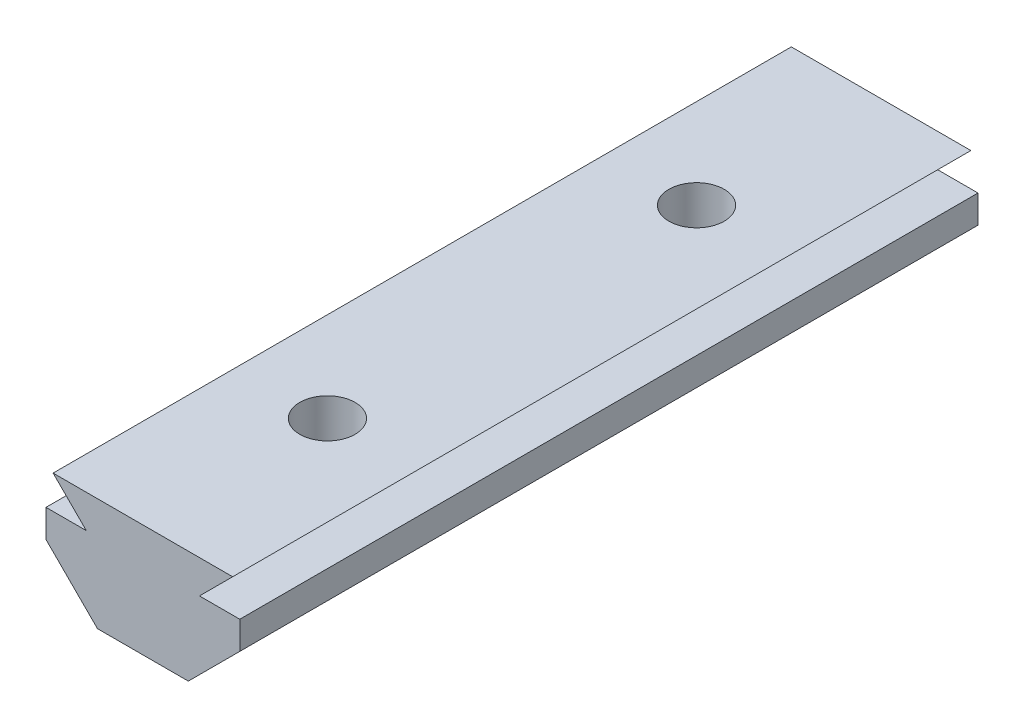
ISO-10303-21;
HEADER;
FILE_DESCRIPTION(('STEP AP214'),'2;1');
FILE_NAME('part.step','',(''),(''),'','','');
FILE_SCHEMA(('AUTOMOTIVE_DESIGN { 1 0 10303 214 1 1 1 1 }'));
ENDSEC;
DATA;
#1=APPLICATION_CONTEXT('core data for automotive mechanical design processes');
#2=APPLICATION_PROTOCOL_DEFINITION('international standard','automotive_design',2000,#1);
#3=PRODUCT_CONTEXT('',#1,'mechanical');
#4=PRODUCT('Part','Part','',(#3));
#5=PRODUCT_RELATED_PRODUCT_CATEGORY('part','',(#4));
#6=PRODUCT_DEFINITION_FORMATION('','',#4);
#7=PRODUCT_DEFINITION_CONTEXT('part definition',#1,'design');
#8=PRODUCT_DEFINITION('design','',#6,#7);
#9=PRODUCT_DEFINITION_SHAPE('','',#8);
#10=(LENGTH_UNIT() NAMED_UNIT(*) SI_UNIT(.MILLI.,.METRE.));
#11=(NAMED_UNIT(*) PLANE_ANGLE_UNIT() SI_UNIT($,.RADIAN.));
#12=(NAMED_UNIT(*) SI_UNIT($,.STERADIAN.) SOLID_ANGLE_UNIT());
#13=UNCERTAINTY_MEASURE_WITH_UNIT(LENGTH_MEASURE(1.E-05),#10,'distance_accuracy_value','');
#14=(GEOMETRIC_REPRESENTATION_CONTEXT(3) GLOBAL_UNCERTAINTY_ASSIGNED_CONTEXT((#13)) GLOBAL_UNIT_ASSIGNED_CONTEXT((#10,
#11,#12)) REPRESENTATION_CONTEXT('',''));
#15=CARTESIAN_POINT('',(0.,0.,0.));
#16=DIRECTION('',(0.,0.,1.));
#17=DIRECTION('',(1.,0.,0.));
#18=AXIS2_PLACEMENT_3D('',#15,#16,#17);
#19=CARTESIAN_POINT('',(-2.46065352773282,0.,40.));
#20=DIRECTION('',(0.,1.,0.));
#21=DIRECTION('',(-1.,0.,0.));
#22=AXIS2_PLACEMENT_3D('',#19,#20,#21);
#23=PLANE('',#22);
#24=DIRECTION('',(0.,0.,-1.));
#25=VECTOR('',#24,1.);
#26=CARTESIAN_POINT('',(2.46065352773283,0.,40.));
#27=LINE('',#26,#25);
#28=CARTESIAN_POINT('',(2.46065352773283,0.,8.66197692985686));
#29=VERTEX_POINT('',#28);
#30=CARTESIAN_POINT('',(2.46065352773283,0.,0.));
#31=VERTEX_POINT('',#30);
#32=EDGE_CURVE('E425',#29,#31,#27,.T.);
#33=ORIENTED_EDGE('',*,*,#32,.F.);
#34=DIRECTION('',(0.5,0.,0.866025403784439));
#35=VECTOR('',#34,1.);
#36=CARTESIAN_POINT('',(1.61658075373095,0.,7.2));
#37=LINE('',#36,#35);
#38=CARTESIAN_POINT('',(1.61658075373095,0.,7.2));
#39=VERTEX_POINT('',#38);
#40=EDGE_CURVE('E261',#39,#29,#37,.T.);
#41=ORIENTED_EDGE('',*,*,#40,.F.);
#42=DIRECTION('',(1.,0.,0.));
#43=VECTOR('',#42,1.);
#44=CARTESIAN_POINT('',(-1.61658075373095,0.,7.2));
#45=LINE('',#44,#43);
#46=CARTESIAN_POINT('',(-1.61658075373095,0.,7.2));
#47=VERTEX_POINT('',#46);
#48=EDGE_CURVE('E243',#47,#39,#45,.T.);
#49=ORIENTED_EDGE('',*,*,#48,.F.);
#50=DIRECTION('',(0.5,0.,-0.866025403784438));
#51=VECTOR('',#50,1.);
#52=CARTESIAN_POINT('',(-3.2331615074619,0.,10.));
#53=LINE('',#52,#51);
#54=CARTESIAN_POINT('',(-2.46065352773282,0.,8.66197692985685));
#55=VERTEX_POINT('',#54);
#56=EDGE_CURVE('E247',#55,#47,#53,.T.);
#57=ORIENTED_EDGE('',*,*,#56,.F.);
#58=DIRECTION('',(0.,0.,-1.));
#59=VECTOR('',#58,1.);
#60=CARTESIAN_POINT('',(-2.46065352773282,0.,40.));
#61=LINE('',#60,#59);
#62=CARTESIAN_POINT('',(-2.46065352773282,0.,0.));
#63=VERTEX_POINT('',#62);
#64=EDGE_CURVE('E461',#55,#63,#61,.T.);
#65=ORIENTED_EDGE('',*,*,#64,.T.);
#66=DIRECTION('',(1.,0.,0.));
#67=VECTOR('',#66,1.);
#68=CARTESIAN_POINT('',(-2.46065352773282,0.,0.));
#69=LINE('',#68,#67);
#70=EDGE_CURVE('E398',#63,#31,#69,.T.);
#71=ORIENTED_EDGE('',*,*,#70,.T.);
#72=EDGE_LOOP('',(#33,#41,#49,#57,#65,#71));
#73=FACE_BOUND('',#72,.T.);
#74=ADVANCED_FACE('F39',(#73),#23,.F.);
#75=CARTESIAN_POINT('',(-2.46065352773283,0.,28.6619769298569));
#76=VERTEX_POINT('',#75);
#77=CARTESIAN_POINT('',(-2.46065352773282,0.,11.3380230701432));
#78=VERTEX_POINT('',#77);
#79=EDGE_CURVE('E468',#76,#78,#61,.T.);
#80=ORIENTED_EDGE('',*,*,#79,.T.);
#81=DIRECTION('',(-0.5,0.,-0.866025403784439));
#82=VECTOR('',#81,1.);
#83=CARTESIAN_POINT('',(-1.61658075373095,0.,12.8));
#84=LINE('',#83,#82);
#85=CARTESIAN_POINT('',(-1.61658075373095,0.,12.8));
#86=VERTEX_POINT('',#85);
#87=EDGE_CURVE('E272',#86,#78,#84,.T.);
#88=ORIENTED_EDGE('',*,*,#87,.F.);
#89=DIRECTION('',(-1.,0.,0.));
#90=VECTOR('',#89,1.);
#91=CARTESIAN_POINT('',(1.61658075373095,0.,12.8));
#92=LINE('',#91,#90);
#93=CARTESIAN_POINT('',(1.61658075373095,0.,12.8));
#94=VERTEX_POINT('',#93);
#95=EDGE_CURVE('E268',#94,#86,#92,.T.);
#96=ORIENTED_EDGE('',*,*,#95,.F.);
#97=DIRECTION('',(-0.5,0.,0.866025403784439));
#98=VECTOR('',#97,1.);
#99=CARTESIAN_POINT('',(3.2331615074619,0.,10.));
#100=LINE('',#99,#98);
#101=CARTESIAN_POINT('',(2.46065352773283,0.,11.3380230701432));
#102=VERTEX_POINT('',#101);
#103=EDGE_CURVE('E264',#102,#94,#100,.T.);
#104=ORIENTED_EDGE('',*,*,#103,.F.);
#105=CARTESIAN_POINT('',(2.46065352773282,0.,28.6619769298568));
#106=VERTEX_POINT('',#105);
#107=EDGE_CURVE('E462',#106,#102,#27,.T.);
#108=ORIENTED_EDGE('',*,*,#107,.F.);
#109=DIRECTION('',(0.499999999999999,0.,0.866025403784439));
#110=VECTOR('',#109,1.);
#111=CARTESIAN_POINT('',(1.61658075373095,0.,27.2));
#112=LINE('',#111,#110);
#113=CARTESIAN_POINT('',(1.61658075373095,0.,27.2));
#114=VERTEX_POINT('',#113);
#115=EDGE_CURVE('E320',#114,#106,#112,.T.);
#116=ORIENTED_EDGE('',*,*,#115,.F.);
#117=DIRECTION('',(1.,0.,0.));
#118=VECTOR('',#117,1.);
#119=CARTESIAN_POINT('',(-1.61658075373094,0.,27.2));
#120=LINE('',#119,#118);
#121=CARTESIAN_POINT('',(-1.61658075373094,0.,27.2));
#122=VERTEX_POINT('',#121);
#123=EDGE_CURVE('E299',#122,#114,#120,.T.);
#124=ORIENTED_EDGE('',*,*,#123,.F.);
#125=DIRECTION('',(0.5,0.,-0.866025403784439));
#126=VECTOR('',#125,1.);
#127=CARTESIAN_POINT('',(-3.2331615074619,0.,30.));
#128=LINE('',#127,#126);
#129=EDGE_CURVE('E333',#76,#122,#128,.T.);
#130=ORIENTED_EDGE('',*,*,#129,.F.);
#131=EDGE_LOOP('',(#80,#88,#96,#104,#108,#116,#124,#130));
#132=FACE_BOUND('',#131,.T.);
#133=ADVANCED_FACE('F505',(#132),#23,.F.);
#134=CARTESIAN_POINT('',(0.,0.,10.));
#135=DIRECTION('',(0.,1.,0.));
#136=DIRECTION('',(-1.,0.,0.));
#137=AXIS2_PLACEMENT_3D('',#134,#135,#136);
#138=CYLINDRICAL_SURFACE('',#137,1.5);
#139=CARTESIAN_POINT('',(0.,6.1,10.));
#140=DIRECTION('',(0.,1.,0.));
#141=DIRECTION('',(-1.,0.,0.));
#142=AXIS2_PLACEMENT_3D('',#139,#140,#141);
#143=CIRCLE('',#142,1.5);
#144=CARTESIAN_POINT('',(-1.5,6.1,10.));
#145=VERTEX_POINT('',#144);
#146=EDGE_CURVE('E384',#145,#145,#143,.T.);
#147=ORIENTED_EDGE('',*,*,#146,.T.);
#148=EDGE_LOOP('',(#147));
#149=FACE_BOUND('',#148,.T.);
#150=CARTESIAN_POINT('',(0.,3.,10.));
#151=DIRECTION('',(0.,-1.,0.));
#152=DIRECTION('',(1.,0.,0.));
#153=AXIS2_PLACEMENT_3D('',#150,#151,#152);
#154=CIRCLE('',#153,1.5);
#155=CARTESIAN_POINT('',(1.5,3.,10.));
#156=VERTEX_POINT('',#155);
#157=EDGE_CURVE('E43',#156,#156,#154,.F.);
#158=ORIENTED_EDGE('',*,*,#157,.F.);
#159=EDGE_LOOP('',(#158));
#160=FACE_BOUND('',#159,.T.);
#161=ADVANCED_FACE('F502',(#149,#160),#138,.F.);
#162=CARTESIAN_POINT('',(0.,0.,30.));
#163=DIRECTION('',(0.,1.,0.));
#164=DIRECTION('',(-1.,0.,0.));
#165=AXIS2_PLACEMENT_3D('',#162,#163,#164);
#166=CYLINDRICAL_SURFACE('',#165,1.5);
#167=CARTESIAN_POINT('',(0.,6.1,30.));
#168=DIRECTION('',(0.,1.,0.));
#169=DIRECTION('',(-1.,0.,0.));
#170=AXIS2_PLACEMENT_3D('',#167,#168,#169);
#171=CIRCLE('',#170,1.5);
#172=CARTESIAN_POINT('',(-1.5,6.1,30.));
#173=VERTEX_POINT('',#172);
#174=EDGE_CURVE('E385',#173,#173,#171,.T.);
#175=ORIENTED_EDGE('',*,*,#174,.T.);
#176=EDGE_LOOP('',(#175));
#177=FACE_BOUND('',#176,.T.);
#178=CARTESIAN_POINT('',(0.,3.,30.));
#179=DIRECTION('',(0.,-1.,0.));
#180=DIRECTION('',(1.,0.,0.));
#181=AXIS2_PLACEMENT_3D('',#178,#179,#180);
#182=CIRCLE('',#181,1.5);
#183=CARTESIAN_POINT('',(1.5,3.,30.));
#184=VERTEX_POINT('',#183);
#185=EDGE_CURVE('E280',#184,#184,#182,.F.);
#186=ORIENTED_EDGE('',*,*,#185,.F.);
#187=EDGE_LOOP('',(#186));
#188=FACE_BOUND('',#187,.T.);
#189=ADVANCED_FACE('F504',(#177,#188),#166,.F.);
#190=CARTESIAN_POINT('',(2.46065352773283,0.,40.));
#191=DIRECTION('',(-0.707106781186543,0.707106781186552,0.));
#192=DIRECTION('',(-0.707106781186552,-0.707106781186543,0.));
#193=AXIS2_PLACEMENT_3D('',#190,#191,#192);
#194=PLANE('',#193);
#195=DIRECTION('',(0.447213595499959,0.447213595499954,-0.774596669241485));
#196=VECTOR('',#195,1.);
#197=CARTESIAN_POINT('',(-7.46814652984304,-9.92880005757574,28.5352092280573));
#198=LINE('',#197,#196);
#199=CARTESIAN_POINT('',(3.2331615074619,0.772507979729072,10.));
#200=VERTEX_POINT('',#199);
#201=EDGE_CURVE('E57',#102,#200,#198,.T.);
#202=ORIENTED_EDGE('',*,*,#201,.T.);
#203=DIRECTION('',(-0.447213595499959,-0.447213595499953,-0.774596669241486));
#204=VECTOR('',#203,1.);
#205=CARTESIAN_POINT('',(13.3164631609836,10.8558096332506,27.4647907719429));
#206=LINE('',#205,#204);
#207=EDGE_CURVE('E223',#200,#29,#206,.T.);
#208=ORIENTED_EDGE('',*,*,#207,.T.);
#209=ORIENTED_EDGE('',*,*,#32,.T.);
#210=DIRECTION('',(0.707106781186552,0.707106781186543,0.));
#211=VECTOR('',#210,1.);
#212=CARTESIAN_POINT('',(2.46065352773283,0.,0.));
#213=LINE('',#212,#211);
#214=CARTESIAN_POINT('',(5.25,2.78934647226715,0.));
#215=VERTEX_POINT('',#214);
#216=EDGE_CURVE('E389',#31,#215,#213,.T.);
#217=ORIENTED_EDGE('',*,*,#216,.T.);
#218=DIRECTION('',(0.,0.,-1.));
#219=VECTOR('',#218,1.);
#220=CARTESIAN_POINT('',(5.25,2.78934647226715,40.));
#221=LINE('',#220,#219);
#222=CARTESIAN_POINT('',(5.25,2.78934647226715,40.));
#223=VERTEX_POINT('',#222);
#224=EDGE_CURVE('E11',#223,#215,#221,.T.);
#225=ORIENTED_EDGE('',*,*,#224,.F.);
#226=DIRECTION('',(0.707106781186552,0.707106781186543,0.));
#227=VECTOR('',#226,1.);
#228=CARTESIAN_POINT('',(2.46065352773283,0.,40.));
#229=LINE('',#228,#227);
#230=CARTESIAN_POINT('',(2.46065352773283,0.,40.));
#231=VERTEX_POINT('',#230);
#232=EDGE_CURVE('E393',#231,#223,#229,.T.);
#233=ORIENTED_EDGE('',*,*,#232,.F.);
#234=CARTESIAN_POINT('',(2.46065352773282,0.,31.3380230701432));
#235=VERTEX_POINT('',#234);
#236=EDGE_CURVE('E457',#231,#235,#27,.T.);
#237=ORIENTED_EDGE('',*,*,#236,.T.);
#238=DIRECTION('',(0.447213595499959,0.447213595499954,-0.774596669241485));
#239=VECTOR('',#238,1.);
#240=CARTESIAN_POINT('',(-0.539943299567495,-3.00059682730028,36.5352092280573));
#241=LINE('',#240,#239);
#242=CARTESIAN_POINT('',(3.23316150746191,0.772507979729079,30.));
#243=VERTEX_POINT('',#242);
#244=EDGE_CURVE('E65',#235,#243,#241,.T.);
#245=ORIENTED_EDGE('',*,*,#244,.T.);
#246=DIRECTION('',(-0.447213595499959,-0.447213595499953,-0.774596669241486));
#247=VECTOR('',#246,1.);
#248=CARTESIAN_POINT('',(6.38825993070805,3.92760640297518,35.4647907719428));
#249=LINE('',#248,#247);
#250=EDGE_CURVE('E368',#243,#106,#249,.T.);
#251=ORIENTED_EDGE('',*,*,#250,.T.);
#252=ORIENTED_EDGE('',*,*,#107,.T.);
#253=EDGE_LOOP('',(#202,#208,#209,#217,#225,#233,#237,#245,#251,#252));
#254=FACE_BOUND('',#253,.T.);
#255=ADVANCED_FACE('F41',(#254),#194,.F.);
#256=CARTESIAN_POINT('',(5.25,2.78934647226715,40.));
#257=DIRECTION('',(-1.,0.,0.));
#258=DIRECTION('',(0.,0.,1.));
#259=AXIS2_PLACEMENT_3D('',#256,#257,#258);
#260=PLANE('',#259);
#261=DIRECTION('',(0.,1.,0.));
#262=VECTOR('',#261,1.);
#263=CARTESIAN_POINT('',(5.25,2.78934647226715,0.));
#264=LINE('',#263,#262);
#265=CARTESIAN_POINT('',(5.25,4.3,0.));
#266=VERTEX_POINT('',#265);
#267=EDGE_CURVE('E429',#215,#266,#264,.T.);
#268=ORIENTED_EDGE('',*,*,#267,.T.);
#269=DIRECTION('',(0.,0.,-1.));
#270=VECTOR('',#269,1.);
#271=CARTESIAN_POINT('',(5.25,4.3,40.));
#272=LINE('',#271,#270);
#273=CARTESIAN_POINT('',(5.25,4.3,40.));
#274=VERTEX_POINT('',#273);
#275=EDGE_CURVE('E49',#274,#266,#272,.T.);
#276=ORIENTED_EDGE('',*,*,#275,.F.);
#277=DIRECTION('',(0.,1.,0.));
#278=VECTOR('',#277,1.);
#279=CARTESIAN_POINT('',(5.25,2.78934647226715,40.));
#280=LINE('',#279,#278);
#281=EDGE_CURVE('E397',#223,#274,#280,.T.);
#282=ORIENTED_EDGE('',*,*,#281,.F.);
#283=ORIENTED_EDGE('',*,*,#224,.T.);
#284=EDGE_LOOP('',(#268,#276,#282,#283));
#285=FACE_BOUND('',#284,.T.);
#286=ADVANCED_FACE('F682',(#285),#260,.F.);
#287=CARTESIAN_POINT('',(5.25,4.3,40.));
#288=DIRECTION('',(0.,-1.,0.));
#289=DIRECTION('',(0.,0.,-1.));
#290=AXIS2_PLACEMENT_3D('',#287,#288,#289);
#291=PLANE('',#290);
#292=DIRECTION('',(-1.,0.,0.));
#293=VECTOR('',#292,1.);
#294=CARTESIAN_POINT('',(5.25,4.3,0.));
#295=LINE('',#294,#293);
#296=CARTESIAN_POINT('',(3.065,4.3,0.));
#297=VERTEX_POINT('',#296);
#298=EDGE_CURVE('E432',#266,#297,#295,.T.);
#299=ORIENTED_EDGE('',*,*,#298,.T.);
#300=DIRECTION('',(0.,0.,-1.));
#301=VECTOR('',#300,1.);
#302=CARTESIAN_POINT('',(3.065,4.3,40.));
#303=LINE('',#302,#301);
#304=CARTESIAN_POINT('',(3.065,4.3,40.));
#305=VERTEX_POINT('',#304);
#306=EDGE_CURVE('E488',#305,#297,#303,.T.);
#307=ORIENTED_EDGE('',*,*,#306,.F.);
#308=DIRECTION('',(-1.,0.,0.));
#309=VECTOR('',#308,1.);
#310=CARTESIAN_POINT('',(5.25,4.3,40.));
#311=LINE('',#310,#309);
#312=EDGE_CURVE('E401',#274,#305,#311,.T.);
#313=ORIENTED_EDGE('',*,*,#312,.F.);
#314=ORIENTED_EDGE('',*,*,#275,.T.);
#315=EDGE_LOOP('',(#299,#307,#313,#314));
#316=FACE_BOUND('',#315,.T.);
#317=ADVANCED_FACE('F672',(#316),#291,.F.);
#318=CARTESIAN_POINT('',(3.065,4.3,40.));
#319=DIRECTION('',(-0.707106781186545,0.70710678118655,0.));
#320=DIRECTION('',(-0.70710678118655,-0.707106781186545,0.));
#321=AXIS2_PLACEMENT_3D('',#318,#319,#320);
#322=PLANE('',#321);
#323=DIRECTION('',(0.70710678118655,0.707106781186545,0.));
#324=VECTOR('',#323,1.);
#325=CARTESIAN_POINT('',(3.065,4.3,0.));
#326=LINE('',#325,#324);
#327=CARTESIAN_POINT('',(4.86500000000002,6.1,0.));
#328=VERTEX_POINT('',#327);
#329=EDGE_CURVE('E435',#297,#328,#326,.T.);
#330=ORIENTED_EDGE('',*,*,#329,.T.);
#331=DIRECTION('',(0.,0.,-1.));
#332=VECTOR('',#331,1.);
#333=CARTESIAN_POINT('',(4.86500000000002,6.1,40.));
#334=LINE('',#333,#332);
#335=CARTESIAN_POINT('',(4.86500000000002,6.1,40.));
#336=VERTEX_POINT('',#335);
#337=EDGE_CURVE('E484',#336,#328,#334,.T.);
#338=ORIENTED_EDGE('',*,*,#337,.F.);
#339=DIRECTION('',(0.70710678118655,0.707106781186545,0.));
#340=VECTOR('',#339,1.);
#341=CARTESIAN_POINT('',(3.065,4.3,40.));
#342=LINE('',#341,#340);
#343=EDGE_CURVE('E404',#305,#336,#342,.T.);
#344=ORIENTED_EDGE('',*,*,#343,.F.);
#345=ORIENTED_EDGE('',*,*,#306,.T.);
#346=EDGE_LOOP('',(#330,#338,#344,#345));
#347=FACE_BOUND('',#346,.T.);
#348=ADVANCED_FACE('F667',(#347),#322,.F.);
#349=CARTESIAN_POINT('',(4.86500000000002,6.1,40.));
#350=DIRECTION('',(0.,-1.,0.));
#351=DIRECTION('',(1.,0.,0.));
#352=AXIS2_PLACEMENT_3D('',#349,#350,#351);
#353=PLANE('',#352);
#354=ORIENTED_EDGE('',*,*,#174,.F.);
#355=EDGE_LOOP('',(#354));
#356=FACE_BOUND('',#355,.T.);
#357=ORIENTED_EDGE('',*,*,#146,.F.);
#358=EDGE_LOOP('',(#357));
#359=FACE_BOUND('',#358,.T.);
#360=DIRECTION('',(-1.,0.,0.));
#361=VECTOR('',#360,1.);
#362=CARTESIAN_POINT('',(4.86500000000002,6.1,0.));
#363=LINE('',#362,#361);
#364=CARTESIAN_POINT('',(-4.86500000000002,6.1,0.));
#365=VERTEX_POINT('',#364);
#366=EDGE_CURVE('E438',#328,#365,#363,.T.);
#367=ORIENTED_EDGE('',*,*,#366,.T.);
#368=DIRECTION('',(0.,0.,-1.));
#369=VECTOR('',#368,1.);
#370=CARTESIAN_POINT('',(-4.86500000000002,6.1,40.));
#371=LINE('',#370,#369);
#372=CARTESIAN_POINT('',(-4.86500000000002,6.1,40.));
#373=VERTEX_POINT('',#372);
#374=EDGE_CURVE('E480',#373,#365,#371,.T.);
#375=ORIENTED_EDGE('',*,*,#374,.F.);
#376=DIRECTION('',(-1.,0.,0.));
#377=VECTOR('',#376,1.);
#378=CARTESIAN_POINT('',(4.86500000000002,6.1,40.));
#379=LINE('',#378,#377);
#380=EDGE_CURVE('E407',#336,#373,#379,.T.);
#381=ORIENTED_EDGE('',*,*,#380,.F.);
#382=ORIENTED_EDGE('',*,*,#337,.T.);
#383=EDGE_LOOP('',(#367,#375,#381,#382));
#384=FACE_BOUND('',#383,.T.);
#385=ADVANCED_FACE('F659',(#356,#359,#384),#353,.F.);
#386=CARTESIAN_POINT('',(-3.065,4.3,40.));
#387=DIRECTION('',(0.707106781186544,0.707106781186551,0.));
#388=DIRECTION('',(-0.707106781186551,0.707106781186544,0.));
#389=AXIS2_PLACEMENT_3D('',#386,#387,#388);
#390=PLANE('',#389);
#391=DIRECTION('',(0.707106781186551,-0.707106781186544,0.));
#392=VECTOR('',#391,1.);
#393=CARTESIAN_POINT('',(-3.065,4.3,0.));
#394=LINE('',#393,#392);
#395=CARTESIAN_POINT('',(-3.065,4.3,0.));
#396=VERTEX_POINT('',#395);
#397=EDGE_CURVE('E441',#365,#396,#394,.T.);
#398=ORIENTED_EDGE('',*,*,#397,.T.);
#399=DIRECTION('',(0.,0.,-1.));
#400=VECTOR('',#399,1.);
#401=CARTESIAN_POINT('',(-3.065,4.3,40.));
#402=LINE('',#401,#400);
#403=CARTESIAN_POINT('',(-3.065,4.3,40.));
#404=VERTEX_POINT('',#403);
#405=EDGE_CURVE('E476',#404,#396,#402,.T.);
#406=ORIENTED_EDGE('',*,*,#405,.F.);
#407=DIRECTION('',(0.707106781186551,-0.707106781186544,0.));
#408=VECTOR('',#407,1.);
#409=CARTESIAN_POINT('',(-3.065,4.3,40.));
#410=LINE('',#409,#408);
#411=EDGE_CURVE('E410',#373,#404,#410,.T.);
#412=ORIENTED_EDGE('',*,*,#411,.F.);
#413=ORIENTED_EDGE('',*,*,#374,.T.);
#414=EDGE_LOOP('',(#398,#406,#412,#413));
#415=FACE_BOUND('',#414,.T.);
#416=ADVANCED_FACE('F649',(#415),#390,.F.);
#417=CARTESIAN_POINT('',(-5.25,4.3,40.));
#418=DIRECTION('',(0.,-1.,0.));
#419=DIRECTION('',(1.,0.,0.));
#420=AXIS2_PLACEMENT_3D('',#417,#418,#419);
#421=PLANE('',#420);
#422=DIRECTION('',(-1.,0.,0.));
#423=VECTOR('',#422,1.);
#424=CARTESIAN_POINT('',(-5.25,4.3,0.));
#425=LINE('',#424,#423);
#426=CARTESIAN_POINT('',(-5.25,4.3,0.));
#427=VERTEX_POINT('',#426);
#428=EDGE_CURVE('E444',#396,#427,#425,.T.);
#429=ORIENTED_EDGE('',*,*,#428,.T.);
#430=DIRECTION('',(0.,0.,-1.));
#431=VECTOR('',#430,1.);
#432=CARTESIAN_POINT('',(-5.25,4.3,40.));
#433=LINE('',#432,#431);
#434=CARTESIAN_POINT('',(-5.25,4.3,40.));
#435=VERTEX_POINT('',#434);
#436=EDGE_CURVE('E472',#435,#427,#433,.T.);
#437=ORIENTED_EDGE('',*,*,#436,.F.);
#438=DIRECTION('',(-1.,0.,0.));
#439=VECTOR('',#438,1.);
#440=CARTESIAN_POINT('',(-5.25,4.3,40.));
#441=LINE('',#440,#439);
#442=EDGE_CURVE('E413',#404,#435,#441,.T.);
#443=ORIENTED_EDGE('',*,*,#442,.F.);
#444=ORIENTED_EDGE('',*,*,#405,.T.);
#445=EDGE_LOOP('',(#429,#437,#443,#444));
#446=FACE_BOUND('',#445,.T.);
#447=ADVANCED_FACE('F639',(#446),#421,.F.);
#448=CARTESIAN_POINT('',(-5.25,2.78934647226715,40.));
#449=DIRECTION('',(1.,0.,0.));
#450=DIRECTION('',(0.,1.,0.));
#451=AXIS2_PLACEMENT_3D('',#448,#449,#450);
#452=PLANE('',#451);
#453=DIRECTION('',(0.,-1.,0.));
#454=VECTOR('',#453,1.);
#455=CARTESIAN_POINT('',(-5.25,2.78934647226715,0.));
#456=LINE('',#455,#454);
#457=CARTESIAN_POINT('',(-5.25,2.78934647226715,0.));
#458=VERTEX_POINT('',#457);
#459=EDGE_CURVE('E447',#427,#458,#456,.T.);
#460=ORIENTED_EDGE('',*,*,#459,.T.);
#461=DIRECTION('',(0.,0.,-1.));
#462=VECTOR('',#461,1.);
#463=CARTESIAN_POINT('',(-5.25,2.78934647226715,40.));
#464=LINE('',#463,#462);
#465=CARTESIAN_POINT('',(-5.25,2.78934647226715,40.));
#466=VERTEX_POINT('',#465);
#467=EDGE_CURVE('E467',#466,#458,#464,.T.);
#468=ORIENTED_EDGE('',*,*,#467,.F.);
#469=DIRECTION('',(0.,-1.,0.));
#470=VECTOR('',#469,1.);
#471=CARTESIAN_POINT('',(-5.25,2.78934647226715,40.));
#472=LINE('',#471,#470);
#473=EDGE_CURVE('E416',#435,#466,#472,.T.);
#474=ORIENTED_EDGE('',*,*,#473,.F.);
#475=ORIENTED_EDGE('',*,*,#436,.T.);
#476=EDGE_LOOP('',(#460,#468,#474,#475));
#477=FACE_BOUND('',#476,.T.);
#478=ADVANCED_FACE('F535',(#477),#452,.F.);
#479=CARTESIAN_POINT('',(-2.46065352773282,0.,40.));
#480=DIRECTION('',(0.707106781186543,0.707106781186552,0.));
#481=DIRECTION('',(-0.707106781186552,0.707106781186543,0.));
#482=AXIS2_PLACEMENT_3D('',#479,#480,#481);
#483=PLANE('',#482);
#484=ORIENTED_EDGE('',*,*,#64,.F.);
#485=DIRECTION('',(-0.447213595499959,0.447213595499954,0.774596669241485));
#486=VECTOR('',#485,1.);
#487=CARTESIAN_POINT('',(-13.3164631609836,10.8558096332506,27.4647907719428));
#488=LINE('',#487,#486);
#489=CARTESIAN_POINT('',(-3.2331615074619,0.772507979729074,10.));
#490=VERTEX_POINT('',#489);
#491=EDGE_CURVE('E378',#55,#490,#488,.T.);
#492=ORIENTED_EDGE('',*,*,#491,.T.);
#493=DIRECTION('',(0.447213595499959,-0.447213595499954,0.774596669241485));
#494=VECTOR('',#493,1.);
#495=CARTESIAN_POINT('',(7.46814652984304,-9.92880005757574,28.5352092280574));
#496=LINE('',#495,#494);
#497=EDGE_CURVE('E374',#490,#78,#496,.T.);
#498=ORIENTED_EDGE('',*,*,#497,.T.);
#499=ORIENTED_EDGE('',*,*,#79,.F.);
#500=DIRECTION('',(-0.447213595499959,0.447213595499954,0.774596669241485));
#501=VECTOR('',#500,1.);
#502=CARTESIAN_POINT('',(-6.38825993070804,3.92760640297518,35.4647907719428));
#503=LINE('',#502,#501);
#504=CARTESIAN_POINT('',(-3.2331615074619,0.772507979729072,30.));
#505=VERTEX_POINT('',#504);
#506=EDGE_CURVE('E364',#76,#505,#503,.T.);
#507=ORIENTED_EDGE('',*,*,#506,.T.);
#508=DIRECTION('',(0.447213595499959,-0.447213595499954,0.774596669241485));
#509=VECTOR('',#508,1.);
#510=CARTESIAN_POINT('',(0.5399432995675,-3.00059682730028,36.5352092280573));
#511=LINE('',#510,#509);
#512=CARTESIAN_POINT('',(-2.46065352773282,0.,31.3380230701431));
#513=VERTEX_POINT('',#512);
#514=EDGE_CURVE('E360',#505,#513,#511,.T.);
#515=ORIENTED_EDGE('',*,*,#514,.T.);
#516=CARTESIAN_POINT('',(-2.46065352773282,0.,40.));
#517=VERTEX_POINT('',#516);
#518=EDGE_CURVE('E463',#517,#513,#61,.T.);
#519=ORIENTED_EDGE('',*,*,#518,.F.);
#520=DIRECTION('',(0.707106781186552,-0.707106781186543,0.));
#521=VECTOR('',#520,1.);
#522=CARTESIAN_POINT('',(-2.46065352773282,0.,40.));
#523=LINE('',#522,#521);
#524=EDGE_CURVE('E419',#466,#517,#523,.T.);
#525=ORIENTED_EDGE('',*,*,#524,.F.);
#526=ORIENTED_EDGE('',*,*,#467,.T.);
#527=DIRECTION('',(0.707106781186552,-0.707106781186543,0.));
#528=VECTOR('',#527,1.);
#529=CARTESIAN_POINT('',(-2.46065352773282,0.,0.));
#530=LINE('',#529,#528);
#531=EDGE_CURVE('E450',#458,#63,#530,.T.);
#532=ORIENTED_EDGE('',*,*,#531,.T.);
#533=EDGE_LOOP('',(#484,#492,#498,#499,#507,#515,#519,#525,#526,#532));
#534=FACE_BOUND('',#533,.T.);
#535=ADVANCED_FACE('F527',(#534),#483,.F.);
#536=ORIENTED_EDGE('',*,*,#518,.T.);
#537=DIRECTION('',(-0.5,0.,-0.866025403784439));
#538=VECTOR('',#537,1.);
#539=CARTESIAN_POINT('',(-1.61658075373095,0.,32.8));
#540=LINE('',#539,#538);
#541=CARTESIAN_POINT('',(-1.61658075373095,0.,32.8));
#542=VERTEX_POINT('',#541);
#543=EDGE_CURVE('E330',#542,#513,#540,.T.);
#544=ORIENTED_EDGE('',*,*,#543,.F.);
#545=DIRECTION('',(-1.,0.,0.));
#546=VECTOR('',#545,1.);
#547=CARTESIAN_POINT('',(1.61658075373096,0.,32.8));
#548=LINE('',#547,#546);
#549=CARTESIAN_POINT('',(1.61658075373096,0.,32.8));
#550=VERTEX_POINT('',#549);
#551=EDGE_CURVE('E326',#550,#542,#548,.T.);
#552=ORIENTED_EDGE('',*,*,#551,.F.);
#553=DIRECTION('',(-0.5,0.,0.866025403784438));
#554=VECTOR('',#553,1.);
#555=CARTESIAN_POINT('',(3.23316150746191,0.,30.));
#556=LINE('',#555,#554);
#557=EDGE_CURVE('E323',#235,#550,#556,.T.);
#558=ORIENTED_EDGE('',*,*,#557,.F.);
#559=ORIENTED_EDGE('',*,*,#236,.F.);
#560=DIRECTION('',(1.,0.,0.));
#561=VECTOR('',#560,1.);
#562=CARTESIAN_POINT('',(-2.46065352773282,0.,40.));
#563=LINE('',#562,#561);
#564=EDGE_CURVE('E422',#517,#231,#563,.T.);
#565=ORIENTED_EDGE('',*,*,#564,.F.);
#566=EDGE_LOOP('',(#536,#544,#552,#558,#559,#565));
#567=FACE_BOUND('',#566,.T.);
#568=ADVANCED_FACE('F516',(#567),#23,.F.);
#569=CARTESIAN_POINT('',(0.,0.,40.));
#570=DIRECTION('',(0.,0.,1.));
#571=DIRECTION('',(1.,0.,0.));
#572=AXIS2_PLACEMENT_3D('',#569,#570,#571);
#573=PLANE('',#572);
#574=ORIENTED_EDGE('',*,*,#232,.T.);
#575=ORIENTED_EDGE('',*,*,#281,.T.);
#576=ORIENTED_EDGE('',*,*,#312,.T.);
#577=ORIENTED_EDGE('',*,*,#343,.T.);
#578=ORIENTED_EDGE('',*,*,#380,.T.);
#579=ORIENTED_EDGE('',*,*,#411,.T.);
#580=ORIENTED_EDGE('',*,*,#442,.T.);
#581=ORIENTED_EDGE('',*,*,#473,.T.);
#582=ORIENTED_EDGE('',*,*,#524,.T.);
#583=ORIENTED_EDGE('',*,*,#564,.T.);
#584=EDGE_LOOP('',(#574,#575,#576,#577,#578,#579,#580,#581,#582,#583));
#585=FACE_BOUND('',#584,.T.);
#586=ADVANCED_FACE('F526',(#585),#573,.T.);
#587=CARTESIAN_POINT('',(0.,0.,0.));
#588=DIRECTION('',(0.,0.,1.));
#589=DIRECTION('',(1.,0.,0.));
#590=AXIS2_PLACEMENT_3D('',#587,#588,#589);
#591=PLANE('',#590);
#592=ORIENTED_EDGE('',*,*,#216,.F.);
#593=ORIENTED_EDGE('',*,*,#70,.F.);
#594=ORIENTED_EDGE('',*,*,#531,.F.);
#595=ORIENTED_EDGE('',*,*,#459,.F.);
#596=ORIENTED_EDGE('',*,*,#428,.F.);
#597=ORIENTED_EDGE('',*,*,#397,.F.);
#598=ORIENTED_EDGE('',*,*,#366,.F.);
#599=ORIENTED_EDGE('',*,*,#329,.F.);
#600=ORIENTED_EDGE('',*,*,#298,.F.);
#601=ORIENTED_EDGE('',*,*,#267,.F.);
#602=EDGE_LOOP('',(#592,#593,#594,#595,#596,#597,#598,#599,#600,#601));
#603=FACE_BOUND('',#602,.T.);
#604=ADVANCED_FACE('F533',(#603),#591,.F.);
#605=CARTESIAN_POINT('',(1.61658075373095,3.,27.2));
#606=DIRECTION('',(0.866025403784439,0.,-0.5));
#607=DIRECTION('',(-0.5,0.,-0.866025403784439));
#608=AXIS2_PLACEMENT_3D('',#605,#606,#607);
#609=PLANE('',#608);
#610=DIRECTION('',(0.,-1.,0.));
#611=VECTOR('',#610,1.);
#612=CARTESIAN_POINT('',(3.23316150746191,3.,30.));
#613=LINE('',#612,#611);
#614=CARTESIAN_POINT('',(3.23316150746191,3.,30.));
#615=VERTEX_POINT('',#614);
#616=EDGE_CURVE('E319',#615,#243,#613,.T.);
#617=ORIENTED_EDGE('',*,*,#616,.F.);
#618=DIRECTION('',(0.499999999999999,0.,0.866025403784439));
#619=VECTOR('',#618,1.);
#620=CARTESIAN_POINT('',(1.61658075373095,3.,27.2));
#621=LINE('',#620,#619);
#622=CARTESIAN_POINT('',(1.61658075373095,3.,27.2));
#623=VERTEX_POINT('',#622);
#624=EDGE_CURVE('E294',#623,#615,#621,.T.);
#625=ORIENTED_EDGE('',*,*,#624,.F.);
#626=DIRECTION('',(0.,-1.,0.));
#627=VECTOR('',#626,1.);
#628=CARTESIAN_POINT('',(1.61658075373095,3.,27.2));
#629=LINE('',#628,#627);
#630=EDGE_CURVE('E265',#623,#114,#629,.T.);
#631=ORIENTED_EDGE('',*,*,#630,.T.);
#632=ORIENTED_EDGE('',*,*,#115,.T.);
#633=ORIENTED_EDGE('',*,*,#250,.F.);
#634=EDGE_LOOP('',(#617,#625,#631,#632,#633));
#635=FACE_BOUND('',#634,.T.);
#636=ADVANCED_FACE('F596',(#635),#609,.F.);
#637=CARTESIAN_POINT('',(-3.2331615074619,3.,30.));
#638=DIRECTION('',(-0.866025403784438,0.,-0.5));
#639=DIRECTION('',(-0.5,0.,0.866025403784439));
#640=AXIS2_PLACEMENT_3D('',#637,#638,#639);
#641=PLANE('',#640);
#642=ORIENTED_EDGE('',*,*,#129,.T.);
#643=DIRECTION('',(0.,-1.,0.));
#644=VECTOR('',#643,1.);
#645=CARTESIAN_POINT('',(-1.61658075373095,3.,27.2));
#646=LINE('',#645,#644);
#647=CARTESIAN_POINT('',(-1.61658075373095,3.,27.2));
#648=VERTEX_POINT('',#647);
#649=EDGE_CURVE('E341',#648,#122,#646,.T.);
#650=ORIENTED_EDGE('',*,*,#649,.F.);
#651=DIRECTION('',(0.5,0.,-0.866025403784439));
#652=VECTOR('',#651,1.);
#653=CARTESIAN_POINT('',(-3.2331615074619,3.,30.));
#654=LINE('',#653,#652);
#655=CARTESIAN_POINT('',(-3.2331615074619,3.,30.));
#656=VERTEX_POINT('',#655);
#657=EDGE_CURVE('E311',#656,#648,#654,.T.);
#658=ORIENTED_EDGE('',*,*,#657,.F.);
#659=DIRECTION('',(0.,-1.,0.));
#660=VECTOR('',#659,1.);
#661=CARTESIAN_POINT('',(-3.2331615074619,3.,30.));
#662=LINE('',#661,#660);
#663=EDGE_CURVE('E345',#656,#505,#662,.T.);
#664=ORIENTED_EDGE('',*,*,#663,.T.);
#665=ORIENTED_EDGE('',*,*,#506,.F.);
#666=EDGE_LOOP('',(#642,#650,#658,#664,#665));
#667=FACE_BOUND('',#666,.T.);
#668=ADVANCED_FACE('F550',(#667),#641,.F.);
#669=CARTESIAN_POINT('',(-1.61658075373095,3.,32.8));
#670=DIRECTION('',(-0.866025403784439,0.,0.5));
#671=DIRECTION('',(0.5,0.,0.866025403784439));
#672=AXIS2_PLACEMENT_3D('',#669,#670,#671);
#673=PLANE('',#672);
#674=ORIENTED_EDGE('',*,*,#663,.F.);
#675=DIRECTION('',(-0.5,0.,-0.866025403784439));
#676=VECTOR('',#675,1.);
#677=CARTESIAN_POINT('',(-1.61658075373095,3.,32.8));
#678=LINE('',#677,#676);
#679=CARTESIAN_POINT('',(-1.61658075373095,3.,32.8));
#680=VERTEX_POINT('',#679);
#681=EDGE_CURVE('E307',#680,#656,#678,.T.);
#682=ORIENTED_EDGE('',*,*,#681,.F.);
#683=DIRECTION('',(0.,-1.,0.));
#684=VECTOR('',#683,1.);
#685=CARTESIAN_POINT('',(-1.61658075373095,3.,32.8));
#686=LINE('',#685,#684);
#687=EDGE_CURVE('E349',#680,#542,#686,.T.);
#688=ORIENTED_EDGE('',*,*,#687,.T.);
#689=ORIENTED_EDGE('',*,*,#543,.T.);
#690=ORIENTED_EDGE('',*,*,#514,.F.);
#691=EDGE_LOOP('',(#674,#682,#688,#689,#690));
#692=FACE_BOUND('',#691,.T.);
#693=ADVANCED_FACE('F546',(#692),#673,.F.);
#694=CARTESIAN_POINT('',(3.23316150746191,3.,30.));
#695=DIRECTION('',(0.866025403784439,0.,0.5));
#696=DIRECTION('',(0.5,0.,-0.866025403784439));
#697=AXIS2_PLACEMENT_3D('',#694,#695,#696);
#698=PLANE('',#697);
#699=ORIENTED_EDGE('',*,*,#557,.T.);
#700=DIRECTION('',(0.,-1.,0.));
#701=VECTOR('',#700,1.);
#702=CARTESIAN_POINT('',(1.61658075373096,3.,32.8));
#703=LINE('',#702,#701);
#704=CARTESIAN_POINT('',(1.61658075373096,3.,32.8));
#705=VERTEX_POINT('',#704);
#706=EDGE_CURVE('E352',#705,#550,#703,.T.);
#707=ORIENTED_EDGE('',*,*,#706,.F.);
#708=DIRECTION('',(-0.5,0.,0.866025403784438));
#709=VECTOR('',#708,1.);
#710=CARTESIAN_POINT('',(3.23316150746191,3.,30.));
#711=LINE('',#710,#709);
#712=EDGE_CURVE('E298',#615,#705,#711,.T.);
#713=ORIENTED_EDGE('',*,*,#712,.F.);
#714=ORIENTED_EDGE('',*,*,#616,.T.);
#715=ORIENTED_EDGE('',*,*,#244,.F.);
#716=EDGE_LOOP('',(#699,#707,#713,#714,#715));
#717=FACE_BOUND('',#716,.T.);
#718=ADVANCED_FACE('F599',(#717),#698,.F.);
#719=CARTESIAN_POINT('',(0.,3.,0.));
#720=DIRECTION('',(0.,-1.,0.));
#721=DIRECTION('',(1.,0.,0.));
#722=AXIS2_PLACEMENT_3D('',#719,#720,#721);
#723=PLANE('',#722);
#724=ORIENTED_EDGE('',*,*,#624,.T.);
#725=ORIENTED_EDGE('',*,*,#712,.T.);
#726=DIRECTION('',(-1.,0.,0.));
#727=VECTOR('',#726,1.);
#728=CARTESIAN_POINT('',(1.61658075373096,3.,32.8));
#729=LINE('',#728,#727);
#730=EDGE_CURVE('E303',#705,#680,#729,.T.);
#731=ORIENTED_EDGE('',*,*,#730,.T.);
#732=ORIENTED_EDGE('',*,*,#681,.T.);
#733=ORIENTED_EDGE('',*,*,#657,.T.);
#734=DIRECTION('',(1.,0.,0.));
#735=VECTOR('',#734,1.);
#736=CARTESIAN_POINT('',(-1.61658075373095,3.,27.2));
#737=LINE('',#736,#735);
#738=EDGE_CURVE('E315',#648,#623,#737,.T.);
#739=ORIENTED_EDGE('',*,*,#738,.T.);
#740=EDGE_LOOP('',(#724,#725,#731,#732,#733,#739));
#741=FACE_BOUND('',#740,.T.);
#742=ORIENTED_EDGE('',*,*,#185,.T.);
#743=EDGE_LOOP('',(#742));
#744=FACE_BOUND('',#743,.T.);
#745=ADVANCED_FACE('F554',(#741,#744),#723,.T.);
#746=CARTESIAN_POINT('',(-1.61658075373095,3.,27.2));
#747=DIRECTION('',(0.,0.,-1.));
#748=DIRECTION('',(-1.,0.,0.));
#749=AXIS2_PLACEMENT_3D('',#746,#747,#748);
#750=PLANE('',#749);
#751=ORIENTED_EDGE('',*,*,#123,.T.);
#752=ORIENTED_EDGE('',*,*,#630,.F.);
#753=ORIENTED_EDGE('',*,*,#738,.F.);
#754=ORIENTED_EDGE('',*,*,#649,.T.);
#755=EDGE_LOOP('',(#751,#752,#753,#754));
#756=FACE_BOUND('',#755,.T.);
#757=ADVANCED_FACE('F601',(#756),#750,.F.);
#758=CARTESIAN_POINT('',(1.61658075373096,3.,32.8));
#759=DIRECTION('',(0.,0.,1.));
#760=DIRECTION('',(1.,0.,0.));
#761=AXIS2_PLACEMENT_3D('',#758,#759,#760);
#762=PLANE('',#761);
#763=ORIENTED_EDGE('',*,*,#551,.T.);
#764=ORIENTED_EDGE('',*,*,#687,.F.);
#765=ORIENTED_EDGE('',*,*,#730,.F.);
#766=ORIENTED_EDGE('',*,*,#706,.T.);
#767=EDGE_LOOP('',(#763,#764,#765,#766));
#768=FACE_BOUND('',#767,.T.);
#769=ADVANCED_FACE('F557',(#768),#762,.F.);
#770=CARTESIAN_POINT('',(1.61658075373095,3.,7.2));
#771=DIRECTION('',(0.866025403784439,0.,-0.5));
#772=DIRECTION('',(-0.5,0.,-0.866025403784439));
#773=AXIS2_PLACEMENT_3D('',#770,#771,#772);
#774=PLANE('',#773);
#775=DIRECTION('',(0.,-1.,0.));
#776=VECTOR('',#775,1.);
#777=CARTESIAN_POINT('',(3.2331615074619,3.,10.));
#778=LINE('',#777,#776);
#779=CARTESIAN_POINT('',(3.2331615074619,3.,10.));
#780=VERTEX_POINT('',#779);
#781=EDGE_CURVE('E216',#780,#200,#778,.T.);
#782=ORIENTED_EDGE('',*,*,#781,.F.);
#783=DIRECTION('',(0.5,0.,0.866025403784439));
#784=VECTOR('',#783,1.);
#785=CARTESIAN_POINT('',(1.61658075373095,3.,7.2));
#786=LINE('',#785,#784);
#787=CARTESIAN_POINT('',(1.61658075373095,3.,7.2));
#788=VERTEX_POINT('',#787);
#789=EDGE_CURVE('E220',#788,#780,#786,.T.);
#790=ORIENTED_EDGE('',*,*,#789,.F.);
#791=DIRECTION('',(0.,-1.,0.));
#792=VECTOR('',#791,1.);
#793=CARTESIAN_POINT('',(1.61658075373095,3.,7.2));
#794=LINE('',#793,#792);
#795=EDGE_CURVE('E277',#788,#39,#794,.T.);
#796=ORIENTED_EDGE('',*,*,#795,.T.);
#797=ORIENTED_EDGE('',*,*,#40,.T.);
#798=ORIENTED_EDGE('',*,*,#207,.F.);
#799=EDGE_LOOP('',(#782,#790,#796,#797,#798));
#800=FACE_BOUND('',#799,.T.);
#801=ADVANCED_FACE('F218',(#800),#774,.F.);
#802=CARTESIAN_POINT('',(-3.2331615074619,3.,10.));
#803=DIRECTION('',(-0.866025403784439,0.,-0.5));
#804=DIRECTION('',(-0.5,0.,0.866025403784439));
#805=AXIS2_PLACEMENT_3D('',#802,#803,#804);
#806=PLANE('',#805);
#807=ORIENTED_EDGE('',*,*,#56,.T.);
#808=DIRECTION('',(0.,-1.,0.));
#809=VECTOR('',#808,1.);
#810=CARTESIAN_POINT('',(-1.61658075373095,3.,7.2));
#811=LINE('',#810,#809);
#812=CARTESIAN_POINT('',(-1.61658075373095,3.,7.2));
#813=VERTEX_POINT('',#812);
#814=EDGE_CURVE('E281',#813,#47,#811,.T.);
#815=ORIENTED_EDGE('',*,*,#814,.F.);
#816=DIRECTION('',(0.5,0.,-0.866025403784438));
#817=VECTOR('',#816,1.);
#818=CARTESIAN_POINT('',(-3.2331615074619,3.,10.));
#819=LINE('',#818,#817);
#820=CARTESIAN_POINT('',(-3.2331615074619,3.,10.));
#821=VERTEX_POINT('',#820);
#822=EDGE_CURVE('E256',#821,#813,#819,.T.);
#823=ORIENTED_EDGE('',*,*,#822,.F.);
#824=DIRECTION('',(0.,-1.,0.));
#825=VECTOR('',#824,1.);
#826=CARTESIAN_POINT('',(-3.2331615074619,3.,10.));
#827=LINE('',#826,#825);
#828=EDGE_CURVE('E285',#821,#490,#827,.T.);
#829=ORIENTED_EDGE('',*,*,#828,.T.);
#830=ORIENTED_EDGE('',*,*,#491,.F.);
#831=EDGE_LOOP('',(#807,#815,#823,#829,#830));
#832=FACE_BOUND('',#831,.T.);
#833=ADVANCED_FACE('F587',(#832),#806,.F.);
#834=CARTESIAN_POINT('',(-1.61658075373095,3.,12.8));
#835=DIRECTION('',(-0.866025403784439,0.,0.5));
#836=DIRECTION('',(0.5,0.,0.866025403784439));
#837=AXIS2_PLACEMENT_3D('',#834,#835,#836);
#838=PLANE('',#837);
#839=ORIENTED_EDGE('',*,*,#828,.F.);
#840=DIRECTION('',(-0.5,0.,-0.866025403784439));
#841=VECTOR('',#840,1.);
#842=CARTESIAN_POINT('',(-1.61658075373095,3.,12.8));
#843=LINE('',#842,#841);
#844=CARTESIAN_POINT('',(-1.61658075373095,3.,12.8));
#845=VERTEX_POINT('',#844);
#846=EDGE_CURVE('E252',#845,#821,#843,.T.);
#847=ORIENTED_EDGE('',*,*,#846,.F.);
#848=DIRECTION('',(0.,-1.,0.));
#849=VECTOR('',#848,1.);
#850=CARTESIAN_POINT('',(-1.61658075373095,3.,12.8));
#851=LINE('',#850,#849);
#852=EDGE_CURVE('E289',#845,#86,#851,.T.);
#853=ORIENTED_EDGE('',*,*,#852,.T.);
#854=ORIENTED_EDGE('',*,*,#87,.T.);
#855=ORIENTED_EDGE('',*,*,#497,.F.);
#856=EDGE_LOOP('',(#839,#847,#853,#854,#855));
#857=FACE_BOUND('',#856,.T.);
#858=ADVANCED_FACE('F583',(#857),#838,.F.);
#859=CARTESIAN_POINT('',(3.2331615074619,3.,10.));
#860=DIRECTION('',(0.866025403784439,0.,0.5));
#861=DIRECTION('',(0.5,0.,-0.866025403784439));
#862=AXIS2_PLACEMENT_3D('',#859,#860,#861);
#863=PLANE('',#862);
#864=ORIENTED_EDGE('',*,*,#103,.T.);
#865=DIRECTION('',(0.,-1.,0.));
#866=VECTOR('',#865,1.);
#867=CARTESIAN_POINT('',(1.61658075373095,3.,12.8));
#868=LINE('',#867,#866);
#869=CARTESIAN_POINT('',(1.61658075373095,3.,12.8));
#870=VERTEX_POINT('',#869);
#871=EDGE_CURVE('E225',#870,#94,#868,.T.);
#872=ORIENTED_EDGE('',*,*,#871,.F.);
#873=DIRECTION('',(-0.5,0.,0.866025403784439));
#874=VECTOR('',#873,1.);
#875=CARTESIAN_POINT('',(3.2331615074619,3.,10.));
#876=LINE('',#875,#874);
#877=EDGE_CURVE('E229',#780,#870,#876,.T.);
#878=ORIENTED_EDGE('',*,*,#877,.F.);
#879=ORIENTED_EDGE('',*,*,#781,.T.);
#880=ORIENTED_EDGE('',*,*,#201,.F.);
#881=EDGE_LOOP('',(#864,#872,#878,#879,#880));
#882=FACE_BOUND('',#881,.T.);
#883=ADVANCED_FACE('F230',(#882),#863,.F.);
#884=CARTESIAN_POINT('',(0.,3.,0.));
#885=DIRECTION('',(0.,-1.,0.));
#886=DIRECTION('',(1.,0.,0.));
#887=AXIS2_PLACEMENT_3D('',#884,#885,#886);
#888=PLANE('',#887);
#889=ORIENTED_EDGE('',*,*,#789,.T.);
#890=ORIENTED_EDGE('',*,*,#877,.T.);
#891=DIRECTION('',(-1.,0.,0.));
#892=VECTOR('',#891,1.);
#893=CARTESIAN_POINT('',(1.61658075373095,3.,12.8));
#894=LINE('',#893,#892);
#895=EDGE_CURVE('E236',#870,#845,#894,.T.);
#896=ORIENTED_EDGE('',*,*,#895,.T.);
#897=ORIENTED_EDGE('',*,*,#846,.T.);
#898=ORIENTED_EDGE('',*,*,#822,.T.);
#899=DIRECTION('',(1.,0.,0.));
#900=VECTOR('',#899,1.);
#901=CARTESIAN_POINT('',(-1.61658075373095,3.,7.2));
#902=LINE('',#901,#900);
#903=EDGE_CURVE('E226',#813,#788,#902,.T.);
#904=ORIENTED_EDGE('',*,*,#903,.T.);
#905=EDGE_LOOP('',(#889,#890,#896,#897,#898,#904));
#906=FACE_BOUND('',#905,.T.);
#907=ORIENTED_EDGE('',*,*,#157,.T.);
#908=EDGE_LOOP('',(#907));
#909=FACE_BOUND('',#908,.T.);
#910=ADVANCED_FACE('F238',(#906,#909),#888,.T.);
#911=CARTESIAN_POINT('',(-1.61658075373095,3.,7.2));
#912=DIRECTION('',(0.,0.,-1.));
#913=DIRECTION('',(-1.,0.,0.));
#914=AXIS2_PLACEMENT_3D('',#911,#912,#913);
#915=PLANE('',#914);
#916=ORIENTED_EDGE('',*,*,#48,.T.);
#917=ORIENTED_EDGE('',*,*,#795,.F.);
#918=ORIENTED_EDGE('',*,*,#903,.F.);
#919=ORIENTED_EDGE('',*,*,#814,.T.);
#920=EDGE_LOOP('',(#916,#917,#918,#919));
#921=FACE_BOUND('',#920,.T.);
#922=ADVANCED_FACE('F810',(#921),#915,.F.);
#923=CARTESIAN_POINT('',(1.61658075373095,3.,12.8));
#924=DIRECTION('',(0.,0.,1.));
#925=DIRECTION('',(1.,0.,0.));
#926=AXIS2_PLACEMENT_3D('',#923,#924,#925);
#927=PLANE('',#926);
#928=ORIENTED_EDGE('',*,*,#95,.T.);
#929=ORIENTED_EDGE('',*,*,#852,.F.);
#930=ORIENTED_EDGE('',*,*,#895,.F.);
#931=ORIENTED_EDGE('',*,*,#871,.T.);
#932=EDGE_LOOP('',(#928,#929,#930,#931));
#933=FACE_BOUND('',#932,.T.);
#934=ADVANCED_FACE('F589',(#933),#927,.F.);
#935=CLOSED_SHELL('',(#74,#133,#161,#189,#255,#286,#317,#348,#385,#416,#447,#478,#535,#568,#586,
#604,#636,#668,#693,#718,#745,#757,#769,#801,#833,#858,#883,#910,#922,#934));
#936=MANIFOLD_SOLID_BREP('B2',#935);
#937=ADVANCED_BREP_SHAPE_REPRESENTATION('',(#18,#936),#14);
#938=SHAPE_DEFINITION_REPRESENTATION(#9,#937);
ENDSEC;
END-ISO-10303-21;
